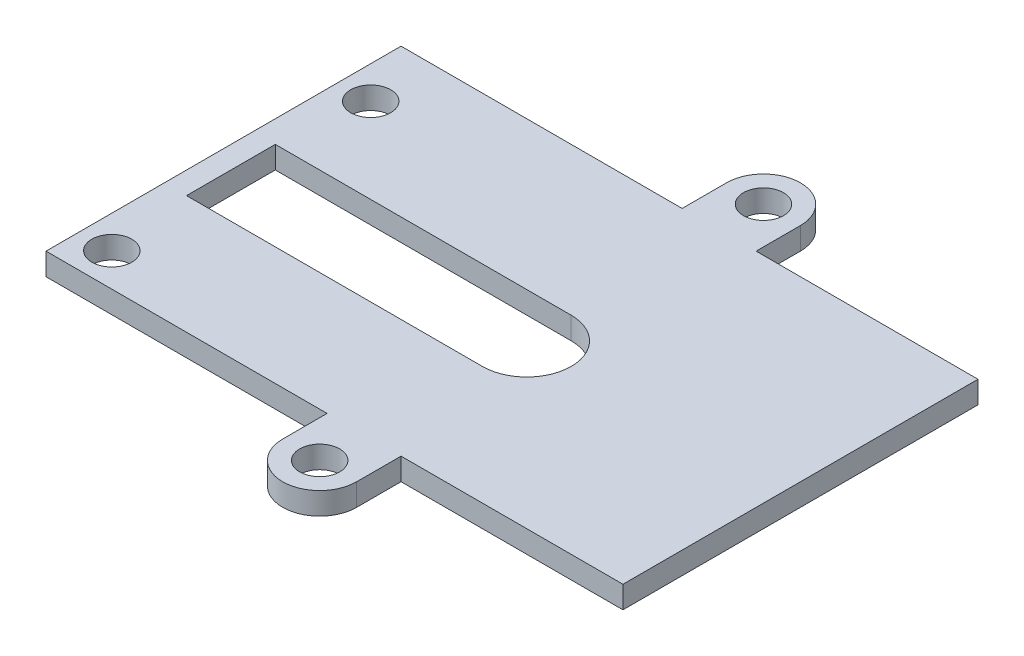
ISO-10303-21;
HEADER;
FILE_DESCRIPTION(('STEP AP214'),'2;1');
FILE_NAME('part.step','',(''),(''),'','','');
FILE_SCHEMA(('AUTOMOTIVE_DESIGN { 1 0 10303 214 1 1 1 1 }'));
ENDSEC;
DATA;
#1=APPLICATION_CONTEXT('core data for automotive mechanical design processes');
#2=APPLICATION_PROTOCOL_DEFINITION('international standard','automotive_design',2000,#1);
#3=PRODUCT_CONTEXT('',#1,'mechanical');
#4=PRODUCT('Part','Part','',(#3));
#5=PRODUCT_RELATED_PRODUCT_CATEGORY('part','',(#4));
#6=PRODUCT_DEFINITION_FORMATION('','',#4);
#7=PRODUCT_DEFINITION_CONTEXT('part definition',#1,'design');
#8=PRODUCT_DEFINITION('design','',#6,#7);
#9=PRODUCT_DEFINITION_SHAPE('','',#8);
#10=(LENGTH_UNIT() NAMED_UNIT(*) SI_UNIT(.MILLI.,.METRE.));
#11=(NAMED_UNIT(*) PLANE_ANGLE_UNIT() SI_UNIT($,.RADIAN.));
#12=(NAMED_UNIT(*) SI_UNIT($,.STERADIAN.) SOLID_ANGLE_UNIT());
#13=UNCERTAINTY_MEASURE_WITH_UNIT(LENGTH_MEASURE(1.E-05),#10,'distance_accuracy_value','');
#14=(GEOMETRIC_REPRESENTATION_CONTEXT(3) GLOBAL_UNCERTAINTY_ASSIGNED_CONTEXT((#13)) GLOBAL_UNIT_ASSIGNED_CONTEXT((#10,
#11,#12)) REPRESENTATION_CONTEXT('',''));
#15=CARTESIAN_POINT('',(0.,0.,0.));
#16=DIRECTION('',(0.,0.,1.));
#17=DIRECTION('',(1.,0.,0.));
#18=AXIS2_PLACEMENT_3D('',#15,#16,#17);
#19=CARTESIAN_POINT('',(17.5,1.5,0.));
#20=DIRECTION('',(1.,0.,0.));
#21=DIRECTION('',(0.,0.,-1.));
#22=AXIS2_PLACEMENT_3D('',#19,#20,#21);
#23=PLANE('',#22);
#24=DIRECTION('',(0.,0.,1.));
#25=VECTOR('',#24,1.);
#26=CARTESIAN_POINT('',(17.5,0.,0.));
#27=LINE('',#26,#25);
#28=CARTESIAN_POINT('',(17.5,0.,-12.));
#29=VERTEX_POINT('',#28);
#30=CARTESIAN_POINT('',(17.5,0.,12.));
#31=VERTEX_POINT('',#30);
#32=EDGE_CURVE('E182',#29,#31,#27,.T.);
#33=ORIENTED_EDGE('',*,*,#32,.F.);
#34=DIRECTION('',(0.,-1.,0.));
#35=VECTOR('',#34,1.);
#36=CARTESIAN_POINT('',(17.5,1.5,-12.));
#37=LINE('',#36,#35);
#38=CARTESIAN_POINT('',(17.5,1.5,-12.));
#39=VERTEX_POINT('',#38);
#40=EDGE_CURVE('E109',#39,#29,#37,.T.);
#41=ORIENTED_EDGE('',*,*,#40,.F.);
#42=DIRECTION('',(0.,0.,1.));
#43=VECTOR('',#42,1.);
#44=CARTESIAN_POINT('',(17.5,1.5,0.));
#45=LINE('',#44,#43);
#46=CARTESIAN_POINT('',(17.5,1.5,12.));
#47=VERTEX_POINT('',#46);
#48=EDGE_CURVE('E280',#39,#47,#45,.T.);
#49=ORIENTED_EDGE('',*,*,#48,.T.);
#50=DIRECTION('',(0.,-1.,0.));
#51=VECTOR('',#50,1.);
#52=CARTESIAN_POINT('',(17.5,1.5,12.));
#53=LINE('',#52,#51);
#54=EDGE_CURVE('E104',#47,#31,#53,.T.);
#55=ORIENTED_EDGE('',*,*,#54,.T.);
#56=EDGE_LOOP('',(#33,#41,#49,#55));
#57=FACE_BOUND('',#56,.T.);
#58=ADVANCED_FACE('F35',(#57),#23,.T.);
#59=CARTESIAN_POINT('',(0.,1.5,-12.));
#60=DIRECTION('',(0.,0.,-1.));
#61=DIRECTION('',(-1.,0.,0.));
#62=AXIS2_PLACEMENT_3D('',#59,#60,#61);
#63=PLANE('',#62);
#64=DIRECTION('',(1.,0.,0.));
#65=VECTOR('',#64,1.);
#66=CARTESIAN_POINT('',(0.,0.,-12.));
#67=LINE('',#66,#65);
#68=CARTESIAN_POINT('',(2.5,0.,-12.));
#69=VERTEX_POINT('',#68);
#70=EDGE_CURVE('E186',#69,#29,#67,.T.);
#71=ORIENTED_EDGE('',*,*,#70,.F.);
#72=DIRECTION('',(0.,-1.,0.));
#73=VECTOR('',#72,1.);
#74=CARTESIAN_POINT('',(2.5,1.5,-12.));
#75=LINE('',#74,#73);
#76=CARTESIAN_POINT('',(2.5,1.5,-12.));
#77=VERTEX_POINT('',#76);
#78=EDGE_CURVE('E242',#77,#69,#75,.T.);
#79=ORIENTED_EDGE('',*,*,#78,.F.);
#80=DIRECTION('',(1.,0.,0.));
#81=VECTOR('',#80,1.);
#82=CARTESIAN_POINT('',(0.,1.5,-12.));
#83=LINE('',#82,#81);
#84=EDGE_CURVE('E282',#77,#39,#83,.T.);
#85=ORIENTED_EDGE('',*,*,#84,.T.);
#86=ORIENTED_EDGE('',*,*,#40,.T.);
#87=EDGE_LOOP('',(#71,#79,#85,#86));
#88=FACE_BOUND('',#87,.T.);
#89=ADVANCED_FACE('F312',(#88),#63,.T.);
#90=CARTESIAN_POINT('',(2.49999999999999,1.5,0.));
#91=DIRECTION('',(1.,0.,0.));
#92=DIRECTION('',(0.,0.,-1.));
#93=AXIS2_PLACEMENT_3D('',#90,#91,#92);
#94=PLANE('',#93);
#95=DIRECTION('',(0.,0.,1.));
#96=VECTOR('',#95,1.);
#97=CARTESIAN_POINT('',(2.49999999999999,0.,0.));
#98=LINE('',#97,#96);
#99=CARTESIAN_POINT('',(2.5,0.,-15.));
#100=VERTEX_POINT('',#99);
#101=EDGE_CURVE('E189',#100,#69,#98,.T.);
#102=ORIENTED_EDGE('',*,*,#101,.F.);
#103=DIRECTION('',(0.,-1.,0.));
#104=VECTOR('',#103,1.);
#105=CARTESIAN_POINT('',(2.5,1.5,-15.));
#106=LINE('',#105,#104);
#107=CARTESIAN_POINT('',(2.5,1.5,-15.));
#108=VERTEX_POINT('',#107);
#109=EDGE_CURVE('E240',#108,#100,#106,.T.);
#110=ORIENTED_EDGE('',*,*,#109,.F.);
#111=DIRECTION('',(0.,0.,1.));
#112=VECTOR('',#111,1.);
#113=CARTESIAN_POINT('',(2.49999999999999,1.5,0.));
#114=LINE('',#113,#112);
#115=EDGE_CURVE('E285',#108,#77,#114,.T.);
#116=ORIENTED_EDGE('',*,*,#115,.T.);
#117=ORIENTED_EDGE('',*,*,#78,.T.);
#118=EDGE_LOOP('',(#102,#110,#116,#117));
#119=FACE_BOUND('',#118,.T.);
#120=ADVANCED_FACE('F315',(#119),#94,.T.);
#121=CARTESIAN_POINT('',(0.,1.5,-15.));
#122=DIRECTION('',(0.,-1.,0.));
#123=DIRECTION('',(0.,0.,-1.));
#124=AXIS2_PLACEMENT_3D('',#121,#122,#123);
#125=CYLINDRICAL_SURFACE('',#124,2.5);
#126=CARTESIAN_POINT('',(0.,0.,-15.));
#127=DIRECTION('',(0.,1.,0.));
#128=DIRECTION('',(0.,0.,1.));
#129=AXIS2_PLACEMENT_3D('',#126,#127,#128);
#130=CIRCLE('',#129,2.5);
#131=CARTESIAN_POINT('',(-2.5,0.,-15.));
#132=VERTEX_POINT('',#131);
#133=EDGE_CURVE('E193',#100,#132,#130,.T.);
#134=ORIENTED_EDGE('',*,*,#133,.T.);
#135=DIRECTION('',(0.,-1.,0.));
#136=VECTOR('',#135,1.);
#137=CARTESIAN_POINT('',(-2.5,1.5,-15.));
#138=LINE('',#137,#136);
#139=CARTESIAN_POINT('',(-2.5,1.5,-15.));
#140=VERTEX_POINT('',#139);
#141=EDGE_CURVE('E237',#140,#132,#138,.T.);
#142=ORIENTED_EDGE('',*,*,#141,.F.);
#143=CARTESIAN_POINT('',(0.,1.5,-15.));
#144=DIRECTION('',(0.,1.,0.));
#145=DIRECTION('',(0.,0.,1.));
#146=AXIS2_PLACEMENT_3D('',#143,#144,#145);
#147=CIRCLE('',#146,2.5);
#148=EDGE_CURVE('E289',#108,#140,#147,.T.);
#149=ORIENTED_EDGE('',*,*,#148,.F.);
#150=ORIENTED_EDGE('',*,*,#109,.T.);
#151=EDGE_LOOP('',(#134,#142,#149,#150));
#152=FACE_BOUND('',#151,.T.);
#153=ADVANCED_FACE('F320',(#152),#125,.T.);
#154=CARTESIAN_POINT('',(-2.50000000000001,1.5,0.));
#155=DIRECTION('',(1.,0.,0.));
#156=DIRECTION('',(0.,0.,-1.));
#157=AXIS2_PLACEMENT_3D('',#154,#155,#156);
#158=PLANE('',#157);
#159=DIRECTION('',(0.,0.,1.));
#160=VECTOR('',#159,1.);
#161=CARTESIAN_POINT('',(-2.50000000000001,0.,0.));
#162=LINE('',#161,#160);
#163=CARTESIAN_POINT('',(-2.5,0.,-12.));
#164=VERTEX_POINT('',#163);
#165=EDGE_CURVE('E196',#132,#164,#162,.T.);
#166=ORIENTED_EDGE('',*,*,#165,.T.);
#167=DIRECTION('',(0.,-1.,0.));
#168=VECTOR('',#167,1.);
#169=CARTESIAN_POINT('',(-2.5,1.5,-12.));
#170=LINE('',#169,#168);
#171=CARTESIAN_POINT('',(-2.5,1.5,-12.));
#172=VERTEX_POINT('',#171);
#173=EDGE_CURVE('E235',#172,#164,#170,.T.);
#174=ORIENTED_EDGE('',*,*,#173,.F.);
#175=DIRECTION('',(0.,0.,1.));
#176=VECTOR('',#175,1.);
#177=CARTESIAN_POINT('',(-2.50000000000001,1.5,0.));
#178=LINE('',#177,#176);
#179=EDGE_CURVE('E292',#140,#172,#178,.T.);
#180=ORIENTED_EDGE('',*,*,#179,.F.);
#181=ORIENTED_EDGE('',*,*,#141,.T.);
#182=EDGE_LOOP('',(#166,#174,#180,#181));
#183=FACE_BOUND('',#182,.T.);
#184=ADVANCED_FACE('F323',(#183),#158,.F.);
#185=CARTESIAN_POINT('',(-21.5,0.,-12.));
#186=VERTEX_POINT('',#185);
#187=EDGE_CURVE('E190',#186,#164,#67,.T.);
#188=ORIENTED_EDGE('',*,*,#187,.F.);
#189=DIRECTION('',(0.,-1.,0.));
#190=VECTOR('',#189,1.);
#191=CARTESIAN_POINT('',(-21.5,1.5,-12.));
#192=LINE('',#191,#190);
#193=CARTESIAN_POINT('',(-21.5,1.5,-12.));
#194=VERTEX_POINT('',#193);
#195=EDGE_CURVE('E233',#194,#186,#192,.T.);
#196=ORIENTED_EDGE('',*,*,#195,.F.);
#197=EDGE_CURVE('E286',#194,#172,#83,.T.);
#198=ORIENTED_EDGE('',*,*,#197,.T.);
#199=ORIENTED_EDGE('',*,*,#173,.T.);
#200=EDGE_LOOP('',(#188,#196,#198,#199));
#201=FACE_BOUND('',#200,.T.);
#202=ADVANCED_FACE('F328',(#201),#63,.T.);
#203=CARTESIAN_POINT('',(-21.5,1.5,0.));
#204=DIRECTION('',(1.,0.,0.));
#205=DIRECTION('',(0.,0.,-1.));
#206=AXIS2_PLACEMENT_3D('',#203,#204,#205);
#207=PLANE('',#206);
#208=DIRECTION('',(0.,0.,1.));
#209=VECTOR('',#208,1.);
#210=CARTESIAN_POINT('',(-21.5,0.,0.));
#211=LINE('',#210,#209);
#212=CARTESIAN_POINT('',(-21.5,0.,12.));
#213=VERTEX_POINT('',#212);
#214=EDGE_CURVE('E199',#186,#213,#211,.T.);
#215=ORIENTED_EDGE('',*,*,#214,.T.);
#216=DIRECTION('',(0.,-1.,0.));
#217=VECTOR('',#216,1.);
#218=CARTESIAN_POINT('',(-21.5,1.5,12.));
#219=LINE('',#218,#217);
#220=CARTESIAN_POINT('',(-21.5,1.5,12.));
#221=VERTEX_POINT('',#220);
#222=EDGE_CURVE('E230',#221,#213,#219,.T.);
#223=ORIENTED_EDGE('',*,*,#222,.F.);
#224=DIRECTION('',(0.,0.,1.));
#225=VECTOR('',#224,1.);
#226=CARTESIAN_POINT('',(-21.5,1.5,0.));
#227=LINE('',#226,#225);
#228=EDGE_CURVE('E294',#194,#221,#227,.T.);
#229=ORIENTED_EDGE('',*,*,#228,.F.);
#230=ORIENTED_EDGE('',*,*,#195,.T.);
#231=EDGE_LOOP('',(#215,#223,#229,#230));
#232=FACE_BOUND('',#231,.T.);
#233=ADVANCED_FACE('F331',(#232),#207,.F.);
#234=CARTESIAN_POINT('',(0.,1.5,12.));
#235=DIRECTION('',(0.,0.,-1.));
#236=DIRECTION('',(-1.,0.,0.));
#237=AXIS2_PLACEMENT_3D('',#234,#235,#236);
#238=PLANE('',#237);
#239=DIRECTION('',(1.,0.,0.));
#240=VECTOR('',#239,1.);
#241=CARTESIAN_POINT('',(0.,0.,12.));
#242=LINE('',#241,#240);
#243=CARTESIAN_POINT('',(-2.5,0.,12.));
#244=VERTEX_POINT('',#243);
#245=EDGE_CURVE('E202',#213,#244,#242,.T.);
#246=ORIENTED_EDGE('',*,*,#245,.T.);
#247=DIRECTION('',(0.,-1.,0.));
#248=VECTOR('',#247,1.);
#249=CARTESIAN_POINT('',(-2.5,1.5,12.));
#250=LINE('',#249,#248);
#251=CARTESIAN_POINT('',(-2.5,1.5,12.));
#252=VERTEX_POINT('',#251);
#253=EDGE_CURVE('E228',#252,#244,#250,.T.);
#254=ORIENTED_EDGE('',*,*,#253,.F.);
#255=DIRECTION('',(1.,0.,0.));
#256=VECTOR('',#255,1.);
#257=CARTESIAN_POINT('',(0.,1.5,12.));
#258=LINE('',#257,#256);
#259=EDGE_CURVE('E163',#221,#252,#258,.T.);
#260=ORIENTED_EDGE('',*,*,#259,.F.);
#261=ORIENTED_EDGE('',*,*,#222,.T.);
#262=EDGE_LOOP('',(#246,#254,#260,#261));
#263=FACE_BOUND('',#262,.T.);
#264=ADVANCED_FACE('F301',(#263),#238,.F.);
#265=CARTESIAN_POINT('',(-2.50000000000001,1.5,0.));
#266=DIRECTION('',(-1.,0.,0.));
#267=DIRECTION('',(0.,0.,1.));
#268=AXIS2_PLACEMENT_3D('',#265,#266,#267);
#269=PLANE('',#268);
#270=DIRECTION('',(0.,0.,-1.));
#271=VECTOR('',#270,1.);
#272=CARTESIAN_POINT('',(-2.50000000000001,0.,0.));
#273=LINE('',#272,#271);
#274=CARTESIAN_POINT('',(-2.5,0.,15.));
#275=VERTEX_POINT('',#274);
#276=EDGE_CURVE('E205',#275,#244,#273,.T.);
#277=ORIENTED_EDGE('',*,*,#276,.F.);
#278=DIRECTION('',(0.,-1.,0.));
#279=VECTOR('',#278,1.);
#280=CARTESIAN_POINT('',(-2.5,1.5,15.));
#281=LINE('',#280,#279);
#282=CARTESIAN_POINT('',(-2.5,1.5,15.));
#283=VERTEX_POINT('',#282);
#284=EDGE_CURVE('E149',#283,#275,#281,.T.);
#285=ORIENTED_EDGE('',*,*,#284,.F.);
#286=DIRECTION('',(0.,0.,-1.));
#287=VECTOR('',#286,1.);
#288=CARTESIAN_POINT('',(-2.50000000000001,1.5,0.));
#289=LINE('',#288,#287);
#290=EDGE_CURVE('E161',#283,#252,#289,.T.);
#291=ORIENTED_EDGE('',*,*,#290,.T.);
#292=ORIENTED_EDGE('',*,*,#253,.T.);
#293=EDGE_LOOP('',(#277,#285,#291,#292));
#294=FACE_BOUND('',#293,.T.);
#295=ADVANCED_FACE('F304',(#294),#269,.T.);
#296=CARTESIAN_POINT('',(0.,1.5,15.));
#297=DIRECTION('',(0.,-1.,0.));
#298=DIRECTION('',(0.,0.,-1.));
#299=AXIS2_PLACEMENT_3D('',#296,#297,#298);
#300=CYLINDRICAL_SURFACE('',#299,2.5);
#301=CARTESIAN_POINT('',(0.,0.,15.));
#302=DIRECTION('',(0.,1.,0.));
#303=DIRECTION('',(0.,0.,1.));
#304=AXIS2_PLACEMENT_3D('',#301,#302,#303);
#305=CIRCLE('',#304,2.5);
#306=CARTESIAN_POINT('',(2.5,0.,15.));
#307=VERTEX_POINT('',#306);
#308=EDGE_CURVE('E145',#307,#275,#305,.F.);
#309=ORIENTED_EDGE('',*,*,#308,.F.);
#310=DIRECTION('',(0.,-1.,0.));
#311=VECTOR('',#310,1.);
#312=CARTESIAN_POINT('',(2.5,1.5,15.));
#313=LINE('',#312,#311);
#314=CARTESIAN_POINT('',(2.5,1.5,15.));
#315=VERTEX_POINT('',#314);
#316=EDGE_CURVE('E139',#315,#307,#313,.T.);
#317=ORIENTED_EDGE('',*,*,#316,.F.);
#318=CARTESIAN_POINT('',(0.,1.5,15.));
#319=DIRECTION('',(0.,1.,0.));
#320=DIRECTION('',(0.,0.,1.));
#321=AXIS2_PLACEMENT_3D('',#318,#319,#320);
#322=CIRCLE('',#321,2.5);
#323=EDGE_CURVE('E143',#315,#283,#322,.F.);
#324=ORIENTED_EDGE('',*,*,#323,.T.);
#325=ORIENTED_EDGE('',*,*,#284,.T.);
#326=EDGE_LOOP('',(#309,#317,#324,#325));
#327=FACE_BOUND('',#326,.T.);
#328=ADVANCED_FACE('F141',(#327),#300,.T.);
#329=CARTESIAN_POINT('',(2.49999999999999,1.5,0.));
#330=DIRECTION('',(-1.,0.,0.));
#331=DIRECTION('',(0.,0.,1.));
#332=AXIS2_PLACEMENT_3D('',#329,#330,#331);
#333=PLANE('',#332);
#334=DIRECTION('',(0.,0.,-1.));
#335=VECTOR('',#334,1.);
#336=CARTESIAN_POINT('',(2.49999999999999,0.,0.));
#337=LINE('',#336,#335);
#338=CARTESIAN_POINT('',(2.5,0.,12.));
#339=VERTEX_POINT('',#338);
#340=EDGE_CURVE('E210',#307,#339,#337,.T.);
#341=ORIENTED_EDGE('',*,*,#340,.T.);
#342=DIRECTION('',(0.,-1.,0.));
#343=VECTOR('',#342,1.);
#344=CARTESIAN_POINT('',(2.5,1.5,12.));
#345=LINE('',#344,#343);
#346=CARTESIAN_POINT('',(2.5,1.5,12.));
#347=VERTEX_POINT('',#346);
#348=EDGE_CURVE('E150',#347,#339,#345,.T.);
#349=ORIENTED_EDGE('',*,*,#348,.F.);
#350=DIRECTION('',(0.,0.,-1.));
#351=VECTOR('',#350,1.);
#352=CARTESIAN_POINT('',(2.49999999999999,1.5,0.));
#353=LINE('',#352,#351);
#354=EDGE_CURVE('E153',#315,#347,#353,.T.);
#355=ORIENTED_EDGE('',*,*,#354,.F.);
#356=ORIENTED_EDGE('',*,*,#316,.T.);
#357=EDGE_LOOP('',(#341,#349,#355,#356));
#358=FACE_BOUND('',#357,.T.);
#359=ADVANCED_FACE('F154',(#358),#333,.F.);
#360=CARTESIAN_POINT('',(0.,1.5,15.));
#361=DIRECTION('',(0.,-1.,0.));
#362=DIRECTION('',(0.,0.,-1.));
#363=AXIS2_PLACEMENT_3D('',#360,#361,#362);
#364=CYLINDRICAL_SURFACE('',#363,1.35);
#365=CARTESIAN_POINT('',(0.,1.5,15.));
#366=DIRECTION('',(0.,1.,0.));
#367=DIRECTION('',(0.,0.,1.));
#368=AXIS2_PLACEMENT_3D('',#365,#366,#367);
#369=CIRCLE('',#368,1.35);
#370=CARTESIAN_POINT('',(0.,1.5,16.35));
#371=VERTEX_POINT('',#370);
#372=EDGE_CURVE('E173',#371,#371,#369,.F.);
#373=ORIENTED_EDGE('',*,*,#372,.F.);
#374=EDGE_LOOP('',(#373));
#375=FACE_BOUND('',#374,.T.);
#376=CARTESIAN_POINT('',(0.,0.,15.));
#377=DIRECTION('',(0.,1.,0.));
#378=DIRECTION('',(0.,0.,1.));
#379=AXIS2_PLACEMENT_3D('',#376,#377,#378);
#380=CIRCLE('',#379,1.35);
#381=CARTESIAN_POINT('',(0.,0.,16.35));
#382=VERTEX_POINT('',#381);
#383=EDGE_CURVE('E218',#382,#382,#380,.F.);
#384=ORIENTED_EDGE('',*,*,#383,.T.);
#385=EDGE_LOOP('',(#384));
#386=FACE_BOUND('',#385,.T.);
#387=ADVANCED_FACE('F395',(#375,#386),#364,.F.);
#388=CARTESIAN_POINT('',(-19.3,1.5,9.75000000000001));
#389=DIRECTION('',(0.,-1.,0.));
#390=DIRECTION('',(0.,0.,-1.));
#391=AXIS2_PLACEMENT_3D('',#388,#389,#390);
#392=CYLINDRICAL_SURFACE('',#391,1.35);
#393=CARTESIAN_POINT('',(-19.3,1.5,9.75000000000001));
#394=DIRECTION('',(0.,1.,0.));
#395=DIRECTION('',(0.,0.,1.));
#396=AXIS2_PLACEMENT_3D('',#393,#394,#395);
#397=CIRCLE('',#396,1.35);
#398=CARTESIAN_POINT('',(-19.3,1.5,11.1));
#399=VERTEX_POINT('',#398);
#400=EDGE_CURVE('E170',#399,#399,#397,.F.);
#401=ORIENTED_EDGE('',*,*,#400,.F.);
#402=EDGE_LOOP('',(#401));
#403=FACE_BOUND('',#402,.T.);
#404=CARTESIAN_POINT('',(-19.3,0.,9.75000000000001));
#405=DIRECTION('',(0.,1.,0.));
#406=DIRECTION('',(0.,0.,1.));
#407=AXIS2_PLACEMENT_3D('',#404,#405,#406);
#408=CIRCLE('',#407,1.35);
#409=CARTESIAN_POINT('',(-19.3,0.,11.1));
#410=VERTEX_POINT('',#409);
#411=EDGE_CURVE('E215',#410,#410,#408,.F.);
#412=ORIENTED_EDGE('',*,*,#411,.T.);
#413=EDGE_LOOP('',(#412));
#414=FACE_BOUND('',#413,.T.);
#415=ADVANCED_FACE('F404',(#403,#414),#392,.F.);
#416=CARTESIAN_POINT('',(-19.3,1.5,-7.75));
#417=DIRECTION('',(0.,-1.,0.));
#418=DIRECTION('',(0.,0.,-1.));
#419=AXIS2_PLACEMENT_3D('',#416,#417,#418);
#420=CYLINDRICAL_SURFACE('',#419,1.35);
#421=CARTESIAN_POINT('',(-19.3,1.5,-7.75));
#422=DIRECTION('',(0.,1.,0.));
#423=DIRECTION('',(0.,0.,1.));
#424=AXIS2_PLACEMENT_3D('',#421,#422,#423);
#425=CIRCLE('',#424,1.35);
#426=CARTESIAN_POINT('',(-19.3,1.5,-6.39999999999999));
#427=VERTEX_POINT('',#426);
#428=EDGE_CURVE('E167',#427,#427,#425,.T.);
#429=ORIENTED_EDGE('',*,*,#428,.T.);
#430=EDGE_LOOP('',(#429));
#431=FACE_BOUND('',#430,.T.);
#432=CARTESIAN_POINT('',(-19.3,0.,-7.75));
#433=DIRECTION('',(0.,1.,0.));
#434=DIRECTION('',(0.,0.,1.));
#435=AXIS2_PLACEMENT_3D('',#432,#433,#434);
#436=CIRCLE('',#435,1.35);
#437=CARTESIAN_POINT('',(-19.3,0.,-6.39999999999999));
#438=VERTEX_POINT('',#437);
#439=EDGE_CURVE('E212',#438,#438,#436,.T.);
#440=ORIENTED_EDGE('',*,*,#439,.F.);
#441=EDGE_LOOP('',(#440));
#442=FACE_BOUND('',#441,.T.);
#443=ADVANCED_FACE('F414',(#431,#442),#420,.F.);
#444=EDGE_CURVE('E206',#339,#31,#242,.T.);
#445=ORIENTED_EDGE('',*,*,#444,.T.);
#446=ORIENTED_EDGE('',*,*,#54,.F.);
#447=EDGE_CURVE('E59',#347,#47,#258,.T.);
#448=ORIENTED_EDGE('',*,*,#447,.F.);
#449=ORIENTED_EDGE('',*,*,#348,.T.);
#450=EDGE_LOOP('',(#445,#446,#448,#449));
#451=FACE_BOUND('',#450,.T.);
#452=ADVANCED_FACE('F307',(#451),#238,.F.);
#453=CARTESIAN_POINT('',(0.,1.5,1.));
#454=DIRECTION('',(0.,-1.,0.));
#455=DIRECTION('',(0.,0.,-1.));
#456=AXIS2_PLACEMENT_3D('',#453,#454,#455);
#457=CYLINDRICAL_SURFACE('',#456,3.);
#458=DIRECTION('',(0.,1.,0.));
#459=VECTOR('',#458,1.);
#460=CARTESIAN_POINT('',(0.,-8.5,4.00000000000001));
#461=LINE('',#460,#459);
#462=CARTESIAN_POINT('',(0.,0.,4.00000000000001));
#463=VERTEX_POINT('',#462);
#464=CARTESIAN_POINT('',(0.,1.5,4.00000000000001));
#465=VERTEX_POINT('',#464);
#466=EDGE_CURVE('E183',#463,#465,#461,.T.);
#467=ORIENTED_EDGE('',*,*,#466,.T.);
#468=CARTESIAN_POINT('',(0.,1.5,1.));
#469=DIRECTION('',(0.,1.,0.));
#470=DIRECTION('',(0.,0.,1.));
#471=AXIS2_PLACEMENT_3D('',#468,#469,#470);
#472=CIRCLE('',#471,3.);
#473=CARTESIAN_POINT('',(0.,1.5,-2.));
#474=VERTEX_POINT('',#473);
#475=EDGE_CURVE('E224',#465,#474,#472,.T.);
#476=ORIENTED_EDGE('',*,*,#475,.T.);
#477=DIRECTION('',(0.,1.,0.));
#478=VECTOR('',#477,1.);
#479=CARTESIAN_POINT('',(0.,-8.5,-2.));
#480=LINE('',#479,#478);
#481=CARTESIAN_POINT('',(0.,0.,-2.));
#482=VERTEX_POINT('',#481);
#483=EDGE_CURVE('E271',#482,#474,#480,.T.);
#484=ORIENTED_EDGE('',*,*,#483,.F.);
#485=CARTESIAN_POINT('',(0.,0.,1.));
#486=DIRECTION('',(0.,1.,0.));
#487=DIRECTION('',(0.,0.,1.));
#488=AXIS2_PLACEMENT_3D('',#485,#486,#487);
#489=CIRCLE('',#488,3.);
#490=EDGE_CURVE('E179',#463,#482,#489,.T.);
#491=ORIENTED_EDGE('',*,*,#490,.F.);
#492=EDGE_LOOP('',(#467,#476,#484,#491));
#493=FACE_BOUND('',#492,.T.);
#494=ADVANCED_FACE('F37',(#493),#457,.F.);
#495=CARTESIAN_POINT('',(0.,1.5,-15.));
#496=DIRECTION('',(0.,-1.,0.));
#497=DIRECTION('',(0.,0.,-1.));
#498=AXIS2_PLACEMENT_3D('',#495,#496,#497);
#499=CYLINDRICAL_SURFACE('',#498,1.35);
#500=CARTESIAN_POINT('',(0.,1.5,-15.));
#501=DIRECTION('',(0.,1.,0.));
#502=DIRECTION('',(0.,0.,1.));
#503=AXIS2_PLACEMENT_3D('',#500,#501,#502);
#504=CIRCLE('',#503,1.35);
#505=CARTESIAN_POINT('',(0.,1.5,-13.65));
#506=VERTEX_POINT('',#505);
#507=EDGE_CURVE('E176',#506,#506,#504,.T.);
#508=ORIENTED_EDGE('',*,*,#507,.T.);
#509=EDGE_LOOP('',(#508));
#510=FACE_BOUND('',#509,.T.);
#511=CARTESIAN_POINT('',(0.,0.,-15.));
#512=DIRECTION('',(0.,1.,0.));
#513=DIRECTION('',(0.,0.,1.));
#514=AXIS2_PLACEMENT_3D('',#511,#512,#513);
#515=CIRCLE('',#514,1.35);
#516=CARTESIAN_POINT('',(0.,0.,-13.65));
#517=VERTEX_POINT('',#516);
#518=EDGE_CURVE('E221',#517,#517,#515,.T.);
#519=ORIENTED_EDGE('',*,*,#518,.F.);
#520=EDGE_LOOP('',(#519));
#521=FACE_BOUND('',#520,.T.);
#522=ADVANCED_FACE('F438',(#510,#521),#499,.F.);
#523=CARTESIAN_POINT('',(0.,1.5,0.));
#524=DIRECTION('',(0.,1.,0.));
#525=DIRECTION('',(0.,0.,1.));
#526=AXIS2_PLACEMENT_3D('',#523,#524,#525);
#527=PLANE('',#526);
#528=DIRECTION('',(1.,0.,0.));
#529=VECTOR('',#528,1.);
#530=CARTESIAN_POINT('',(-20.,1.5,4.00000000000001));
#531=LINE('',#530,#529);
#532=CARTESIAN_POINT('',(-20.,1.5,4.00000000000001));
#533=VERTEX_POINT('',#532);
#534=EDGE_CURVE('E277',#533,#465,#531,.T.);
#535=ORIENTED_EDGE('',*,*,#534,.F.);
#536=DIRECTION('',(0.,0.,1.));
#537=VECTOR('',#536,1.);
#538=CARTESIAN_POINT('',(-20.,1.5,-1.99999999999999));
#539=LINE('',#538,#537);
#540=CARTESIAN_POINT('',(-20.,1.5,-1.99999999999999));
#541=VERTEX_POINT('',#540);
#542=EDGE_CURVE('E264',#541,#533,#539,.T.);
#543=ORIENTED_EDGE('',*,*,#542,.F.);
#544=DIRECTION('',(-1.,0.,0.));
#545=VECTOR('',#544,1.);
#546=CARTESIAN_POINT('',(0.,1.5,-2.));
#547=LINE('',#546,#545);
#548=EDGE_CURVE('E503',#474,#541,#547,.T.);
#549=ORIENTED_EDGE('',*,*,#548,.F.);
#550=ORIENTED_EDGE('',*,*,#475,.F.);
#551=EDGE_LOOP('',(#535,#543,#549,#550));
#552=FACE_BOUND('',#551,.T.);
#553=ORIENTED_EDGE('',*,*,#48,.F.);
#554=ORIENTED_EDGE('',*,*,#84,.F.);
#555=ORIENTED_EDGE('',*,*,#115,.F.);
#556=ORIENTED_EDGE('',*,*,#148,.T.);
#557=ORIENTED_EDGE('',*,*,#179,.T.);
#558=ORIENTED_EDGE('',*,*,#197,.F.);
#559=ORIENTED_EDGE('',*,*,#228,.T.);
#560=ORIENTED_EDGE('',*,*,#259,.T.);
#561=ORIENTED_EDGE('',*,*,#290,.F.);
#562=ORIENTED_EDGE('',*,*,#323,.F.);
#563=ORIENTED_EDGE('',*,*,#354,.T.);
#564=ORIENTED_EDGE('',*,*,#447,.T.);
#565=EDGE_LOOP('',(#553,#554,#555,#556,#557,#558,#559,#560,#561,#562,#563,#564));
#566=FACE_BOUND('',#565,.T.);
#567=ORIENTED_EDGE('',*,*,#428,.F.);
#568=EDGE_LOOP('',(#567));
#569=FACE_BOUND('',#568,.T.);
#570=ORIENTED_EDGE('',*,*,#400,.T.);
#571=EDGE_LOOP('',(#570));
#572=FACE_BOUND('',#571,.T.);
#573=ORIENTED_EDGE('',*,*,#372,.T.);
#574=EDGE_LOOP('',(#573));
#575=FACE_BOUND('',#574,.T.);
#576=ORIENTED_EDGE('',*,*,#507,.F.);
#577=EDGE_LOOP('',(#576));
#578=FACE_BOUND('',#577,.T.);
#579=ADVANCED_FACE('F158',(#552,#566,#569,#572,#575,#578),#527,.T.);
#580=CARTESIAN_POINT('',(0.,0.,0.));
#581=DIRECTION('',(0.,1.,0.));
#582=DIRECTION('',(0.,0.,1.));
#583=AXIS2_PLACEMENT_3D('',#580,#581,#582);
#584=PLANE('',#583);
#585=DIRECTION('',(0.,0.,1.));
#586=VECTOR('',#585,1.);
#587=CARTESIAN_POINT('',(-20.,0.,0.));
#588=LINE('',#587,#586);
#589=CARTESIAN_POINT('',(-20.,0.,-1.99999999999999));
#590=VERTEX_POINT('',#589);
#591=CARTESIAN_POINT('',(-20.,0.,4.00000000000001));
#592=VERTEX_POINT('',#591);
#593=EDGE_CURVE('E43',#590,#592,#588,.T.);
#594=ORIENTED_EDGE('',*,*,#593,.T.);
#595=DIRECTION('',(1.,0.,0.));
#596=VECTOR('',#595,1.);
#597=CARTESIAN_POINT('',(0.,0.,4.00000000000001));
#598=LINE('',#597,#596);
#599=EDGE_CURVE('E11',#592,#463,#598,.T.);
#600=ORIENTED_EDGE('',*,*,#599,.T.);
#601=ORIENTED_EDGE('',*,*,#490,.T.);
#602=DIRECTION('',(-1.,0.,0.));
#603=VECTOR('',#602,1.);
#604=CARTESIAN_POINT('',(0.,0.,-2.));
#605=LINE('',#604,#603);
#606=EDGE_CURVE('E245',#482,#590,#605,.T.);
#607=ORIENTED_EDGE('',*,*,#606,.T.);
#608=EDGE_LOOP('',(#594,#600,#601,#607));
#609=FACE_BOUND('',#608,.T.);
#610=ORIENTED_EDGE('',*,*,#32,.T.);
#611=ORIENTED_EDGE('',*,*,#444,.F.);
#612=ORIENTED_EDGE('',*,*,#340,.F.);
#613=ORIENTED_EDGE('',*,*,#308,.T.);
#614=ORIENTED_EDGE('',*,*,#276,.T.);
#615=ORIENTED_EDGE('',*,*,#245,.F.);
#616=ORIENTED_EDGE('',*,*,#214,.F.);
#617=ORIENTED_EDGE('',*,*,#187,.T.);
#618=ORIENTED_EDGE('',*,*,#165,.F.);
#619=ORIENTED_EDGE('',*,*,#133,.F.);
#620=ORIENTED_EDGE('',*,*,#101,.T.);
#621=ORIENTED_EDGE('',*,*,#70,.T.);
#622=EDGE_LOOP('',(#610,#611,#612,#613,#614,#615,#616,#617,#618,#619,#620,#621));
#623=FACE_BOUND('',#622,.T.);
#624=ORIENTED_EDGE('',*,*,#439,.T.);
#625=EDGE_LOOP('',(#624));
#626=FACE_BOUND('',#625,.T.);
#627=ORIENTED_EDGE('',*,*,#411,.F.);
#628=EDGE_LOOP('',(#627));
#629=FACE_BOUND('',#628,.T.);
#630=ORIENTED_EDGE('',*,*,#383,.F.);
#631=EDGE_LOOP('',(#630));
#632=FACE_BOUND('',#631,.T.);
#633=ORIENTED_EDGE('',*,*,#518,.T.);
#634=EDGE_LOOP('',(#633));
#635=FACE_BOUND('',#634,.T.);
#636=ADVANCED_FACE('F250',(#609,#623,#626,#629,#632,#635),#584,.F.);
#637=CARTESIAN_POINT('',(-20.,-8.5,4.00000000000001));
#638=DIRECTION('',(0.,0.,1.));
#639=DIRECTION('',(1.,0.,0.));
#640=AXIS2_PLACEMENT_3D('',#637,#638,#639);
#641=PLANE('',#640);
#642=DIRECTION('',(0.,1.,0.));
#643=VECTOR('',#642,1.);
#644=CARTESIAN_POINT('',(-20.,-8.5,4.00000000000001));
#645=LINE('',#644,#643);
#646=EDGE_CURVE('E261',#592,#533,#645,.T.);
#647=ORIENTED_EDGE('',*,*,#646,.T.);
#648=ORIENTED_EDGE('',*,*,#534,.T.);
#649=ORIENTED_EDGE('',*,*,#466,.F.);
#650=ORIENTED_EDGE('',*,*,#599,.F.);
#651=EDGE_LOOP('',(#647,#648,#649,#650));
#652=FACE_BOUND('',#651,.T.);
#653=ADVANCED_FACE('F470',(#652),#641,.F.);
#654=CARTESIAN_POINT('',(-20.,-8.5,-1.99999999999999));
#655=DIRECTION('',(-1.,0.,0.));
#656=DIRECTION('',(0.,0.,1.));
#657=AXIS2_PLACEMENT_3D('',#654,#655,#656);
#658=PLANE('',#657);
#659=DIRECTION('',(0.,1.,0.));
#660=VECTOR('',#659,1.);
#661=CARTESIAN_POINT('',(-20.,-8.5,-1.99999999999999));
#662=LINE('',#661,#660);
#663=EDGE_CURVE('E50',#590,#541,#662,.T.);
#664=ORIENTED_EDGE('',*,*,#663,.T.);
#665=ORIENTED_EDGE('',*,*,#542,.T.);
#666=ORIENTED_EDGE('',*,*,#646,.F.);
#667=ORIENTED_EDGE('',*,*,#593,.F.);
#668=EDGE_LOOP('',(#664,#665,#666,#667));
#669=FACE_BOUND('',#668,.T.);
#670=ADVANCED_FACE('F257',(#669),#658,.F.);
#671=CARTESIAN_POINT('',(0.,-8.5,-2.));
#672=DIRECTION('',(0.,0.,-1.));
#673=DIRECTION('',(-1.,0.,0.));
#674=AXIS2_PLACEMENT_3D('',#671,#672,#673);
#675=PLANE('',#674);
#676=ORIENTED_EDGE('',*,*,#483,.T.);
#677=ORIENTED_EDGE('',*,*,#548,.T.);
#678=ORIENTED_EDGE('',*,*,#663,.F.);
#679=ORIENTED_EDGE('',*,*,#606,.F.);
#680=EDGE_LOOP('',(#676,#677,#678,#679));
#681=FACE_BOUND('',#680,.T.);
#682=ADVANCED_FACE('F488',(#681),#675,.F.);
#683=CLOSED_SHELL('',(#58,#89,#120,#153,#184,#202,#233,#264,#295,#328,#359,#387,#415,#443,#452,
#494,#522,#579,#636,#653,#670,#682));
#684=MANIFOLD_SOLID_BREP('B2',#683);
#685=ADVANCED_BREP_SHAPE_REPRESENTATION('',(#18,#684),#14);
#686=SHAPE_DEFINITION_REPRESENTATION(#9,#685);
ENDSEC;
END-ISO-10303-21;
